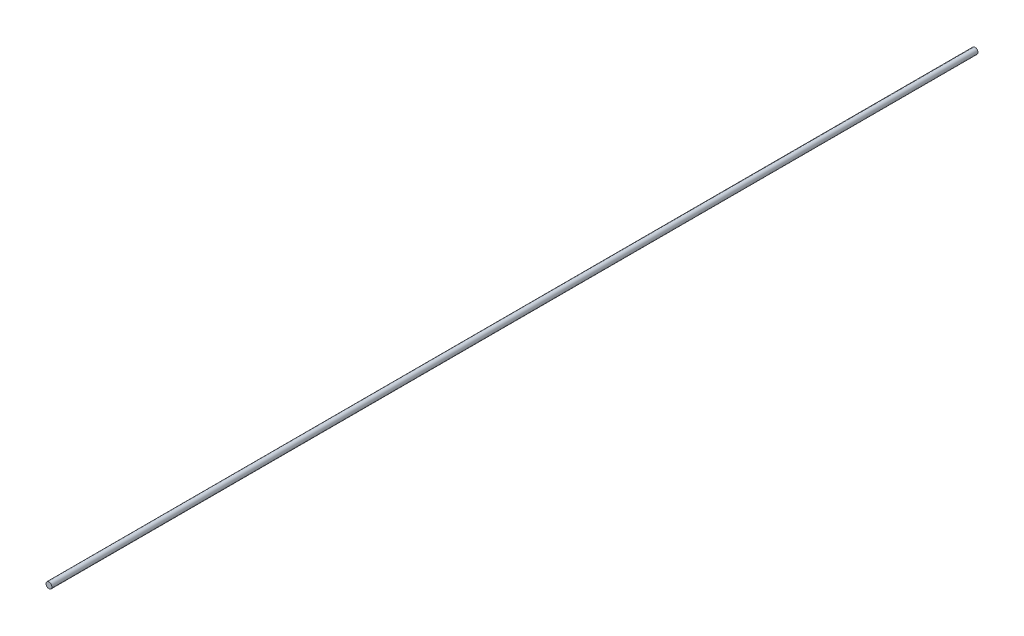
ISO-10303-21;
HEADER;
FILE_DESCRIPTION(('STEP AP214'),'2;1');
FILE_NAME('part.step','',(''),(''),'','','');
FILE_SCHEMA(('AUTOMOTIVE_DESIGN { 1 0 10303 214 1 1 1 1 }'));
ENDSEC;
DATA;
#1=APPLICATION_CONTEXT('core data for automotive mechanical design processes');
#2=APPLICATION_PROTOCOL_DEFINITION('international standard','automotive_design',2000,#1);
#3=PRODUCT_CONTEXT('',#1,'mechanical');
#4=PRODUCT('Part','Part','',(#3));
#5=PRODUCT_RELATED_PRODUCT_CATEGORY('part','',(#4));
#6=PRODUCT_DEFINITION_FORMATION('','',#4);
#7=PRODUCT_DEFINITION_CONTEXT('part definition',#1,'design');
#8=PRODUCT_DEFINITION('design','',#6,#7);
#9=PRODUCT_DEFINITION_SHAPE('','',#8);
#10=(LENGTH_UNIT() NAMED_UNIT(*) SI_UNIT(.MILLI.,.METRE.));
#11=(NAMED_UNIT(*) PLANE_ANGLE_UNIT() SI_UNIT($,.RADIAN.));
#12=(NAMED_UNIT(*) SI_UNIT($,.STERADIAN.) SOLID_ANGLE_UNIT());
#13=UNCERTAINTY_MEASURE_WITH_UNIT(LENGTH_MEASURE(1.E-05),#10,'distance_accuracy_value','');
#14=(GEOMETRIC_REPRESENTATION_CONTEXT(3) GLOBAL_UNCERTAINTY_ASSIGNED_CONTEXT((#13)) GLOBAL_UNIT_ASSIGNED_CONTEXT((#10,
#11,#12)) REPRESENTATION_CONTEXT('',''));
#15=CARTESIAN_POINT('',(0.,0.,0.));
#16=DIRECTION('',(0.,0.,1.));
#17=DIRECTION('',(1.,0.,0.));
#18=AXIS2_PLACEMENT_3D('',#15,#16,#17);
#19=CARTESIAN_POINT('',(0.,0.,2500.));
#20=DIRECTION('',(0.,0.,-1.));
#21=DIRECTION('',(-1.,0.,0.));
#22=AXIS2_PLACEMENT_3D('',#19,#20,#21);
#23=CYLINDRICAL_SURFACE('',#22,8.);
#24=CARTESIAN_POINT('',(0.,0.,2500.));
#25=DIRECTION('',(0.,0.,1.));
#26=DIRECTION('',(1.,0.,0.));
#27=AXIS2_PLACEMENT_3D('',#24,#25,#26);
#28=CIRCLE('',#27,8.);
#29=CARTESIAN_POINT('',(8.,0.,2500.));
#30=VERTEX_POINT('',#29);
#31=EDGE_CURVE('E10',#30,#30,#28,.T.);
#32=ORIENTED_EDGE('',*,*,#31,.F.);
#33=EDGE_LOOP('',(#32));
#34=FACE_BOUND('',#33,.T.);
#35=CARTESIAN_POINT('',(0.,0.,0.));
#36=DIRECTION('',(0.,0.,1.));
#37=DIRECTION('',(1.,0.,0.));
#38=AXIS2_PLACEMENT_3D('',#35,#36,#37);
#39=CIRCLE('',#38,8.);
#40=CARTESIAN_POINT('',(8.,0.,0.));
#41=VERTEX_POINT('',#40);
#42=EDGE_CURVE('E40',#41,#41,#39,.T.);
#43=ORIENTED_EDGE('',*,*,#42,.T.);
#44=EDGE_LOOP('',(#43));
#45=FACE_BOUND('',#44,.T.);
#46=ADVANCED_FACE('F37',(#34,#45),#23,.T.);
#47=CARTESIAN_POINT('',(0.,0.,2500.));
#48=DIRECTION('',(0.,0.,1.));
#49=DIRECTION('',(1.,0.,0.));
#50=AXIS2_PLACEMENT_3D('',#47,#48,#49);
#51=PLANE('',#50);
#52=ORIENTED_EDGE('',*,*,#31,.T.);
#53=EDGE_LOOP('',(#52));
#54=FACE_BOUND('',#53,.T.);
#55=ADVANCED_FACE('F54',(#54),#51,.T.);
#56=CARTESIAN_POINT('',(0.,0.,0.));
#57=DIRECTION('',(0.,0.,1.));
#58=DIRECTION('',(1.,0.,0.));
#59=AXIS2_PLACEMENT_3D('',#56,#57,#58);
#60=PLANE('',#59);
#61=ORIENTED_EDGE('',*,*,#42,.F.);
#62=EDGE_LOOP('',(#61));
#63=FACE_BOUND('',#62,.T.);
#64=ADVANCED_FACE('F52',(#63),#60,.F.);
#65=CLOSED_SHELL('',(#46,#55,#64));
#66=MANIFOLD_SOLID_BREP('B2',#65);
#67=ADVANCED_BREP_SHAPE_REPRESENTATION('',(#18,#66),#14);
#68=SHAPE_DEFINITION_REPRESENTATION(#9,#67);
ENDSEC;
END-ISO-10303-21;
